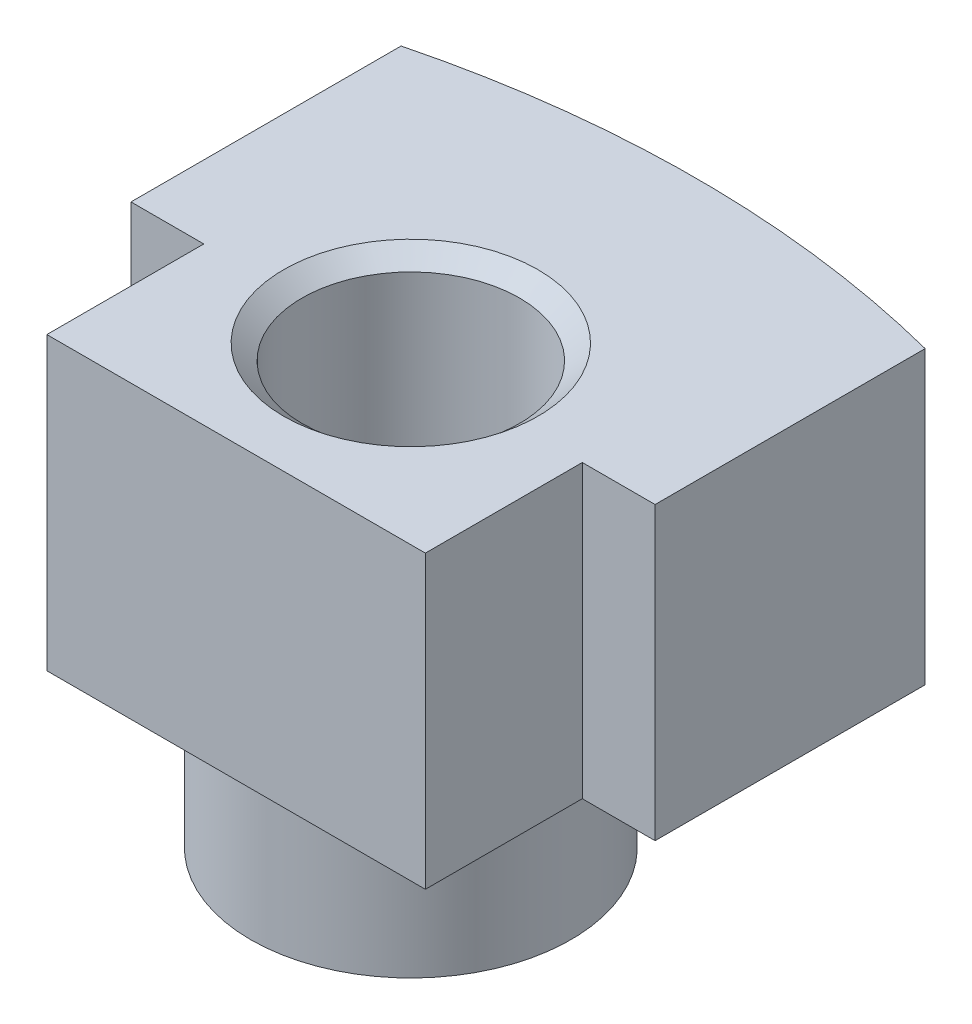
ISO-10303-21;
HEADER;
FILE_DESCRIPTION(('STEP AP214'),'2;1');
FILE_NAME('part.step','',(''),(''),'','','');
FILE_SCHEMA(('AUTOMOTIVE_DESIGN { 1 0 10303 214 1 1 1 1 }'));
ENDSEC;
DATA;
#1=APPLICATION_CONTEXT('core data for automotive mechanical design processes');
#2=APPLICATION_PROTOCOL_DEFINITION('international standard','automotive_design',2000,#1);
#3=PRODUCT_CONTEXT('',#1,'mechanical');
#4=PRODUCT('Part','Part','',(#3));
#5=PRODUCT_RELATED_PRODUCT_CATEGORY('part','',(#4));
#6=PRODUCT_DEFINITION_FORMATION('','',#4);
#7=PRODUCT_DEFINITION_CONTEXT('part definition',#1,'design');
#8=PRODUCT_DEFINITION('design','',#6,#7);
#9=PRODUCT_DEFINITION_SHAPE('','',#8);
#10=(LENGTH_UNIT() NAMED_UNIT(*) SI_UNIT(.MILLI.,.METRE.));
#11=(NAMED_UNIT(*) PLANE_ANGLE_UNIT() SI_UNIT($,.RADIAN.));
#12=(NAMED_UNIT(*) SI_UNIT($,.STERADIAN.) SOLID_ANGLE_UNIT());
#13=UNCERTAINTY_MEASURE_WITH_UNIT(LENGTH_MEASURE(1.E-05),#10,'distance_accuracy_value','');
#14=(GEOMETRIC_REPRESENTATION_CONTEXT(3) GLOBAL_UNCERTAINTY_ASSIGNED_CONTEXT((#13)) GLOBAL_UNIT_ASSIGNED_CONTEXT((#10,
#11,#12)) REPRESENTATION_CONTEXT('',''));
#15=CARTESIAN_POINT('',(0.,0.,0.));
#16=DIRECTION('',(0.,0.,1.));
#17=DIRECTION('',(1.,0.,0.));
#18=AXIS2_PLACEMENT_3D('',#15,#16,#17);
#19=CARTESIAN_POINT('',(-22.86,25.4,0.));
#20=DIRECTION('',(1.,0.,0.));
#21=DIRECTION('',(0.,0.,-1.));
#22=AXIS2_PLACEMENT_3D('',#19,#20,#21);
#23=PLANE('',#22);
#24=DIRECTION('',(0.,0.,1.));
#25=VECTOR('',#24,1.);
#26=CARTESIAN_POINT('',(-22.86,0.,0.));
#27=LINE('',#26,#25);
#28=CARTESIAN_POINT('',(-22.8600000000001,0.,0.));
#29=VERTEX_POINT('',#28);
#30=CARTESIAN_POINT('',(-22.86,0.,23.5589088817742));
#31=VERTEX_POINT('',#30);
#32=EDGE_CURVE('E147',#29,#31,#27,.T.);
#33=ORIENTED_EDGE('',*,*,#32,.T.);
#34=DIRECTION('',(0.,-1.,0.));
#35=VECTOR('',#34,1.);
#36=CARTESIAN_POINT('',(-22.86,25.4,23.5589088817742));
#37=LINE('',#36,#35);
#38=CARTESIAN_POINT('',(-22.86,25.4,23.5589088817742));
#39=VERTEX_POINT('',#38);
#40=EDGE_CURVE('E53',#39,#31,#37,.T.);
#41=ORIENTED_EDGE('',*,*,#40,.F.);
#42=DIRECTION('',(0.,0.,1.));
#43=VECTOR('',#42,1.);
#44=CARTESIAN_POINT('',(-22.86,25.4,0.));
#45=LINE('',#44,#43);
#46=CARTESIAN_POINT('',(-22.8600000000001,25.4,0.));
#47=VERTEX_POINT('',#46);
#48=EDGE_CURVE('E164',#47,#39,#45,.T.);
#49=ORIENTED_EDGE('',*,*,#48,.F.);
#50=DIRECTION('',(0.,-1.,0.));
#51=VECTOR('',#50,1.);
#52=CARTESIAN_POINT('',(-22.8600000000001,25.4,0.));
#53=LINE('',#52,#51);
#54=EDGE_CURVE('E62',#47,#29,#53,.T.);
#55=ORIENTED_EDGE('',*,*,#54,.T.);
#56=EDGE_LOOP('',(#33,#41,#49,#55));
#57=FACE_BOUND('',#56,.T.);
#58=ADVANCED_FACE('F39',(#57),#23,.F.);
#59=CARTESIAN_POINT('',(-22.86,25.4,23.5589088817742));
#60=DIRECTION('',(0.,0.,-1.));
#61=DIRECTION('',(-1.,0.,0.));
#62=AXIS2_PLACEMENT_3D('',#59,#60,#61);
#63=PLANE('',#62);
#64=DIRECTION('',(1.,0.,0.));
#65=VECTOR('',#64,1.);
#66=CARTESIAN_POINT('',(-22.86,0.,23.5589088817742));
#67=LINE('',#66,#65);
#68=CARTESIAN_POINT('',(-16.51,0.,23.5589088817742));
#69=VERTEX_POINT('',#68);
#70=EDGE_CURVE('E149',#31,#69,#67,.T.);
#71=ORIENTED_EDGE('',*,*,#70,.T.);
#72=DIRECTION('',(0.,-1.,0.));
#73=VECTOR('',#72,1.);
#74=CARTESIAN_POINT('',(-16.51,25.4,23.5589088817742));
#75=LINE('',#74,#73);
#76=CARTESIAN_POINT('',(-16.51,25.4,23.5589088817742));
#77=VERTEX_POINT('',#76);
#78=EDGE_CURVE('E174',#77,#69,#75,.T.);
#79=ORIENTED_EDGE('',*,*,#78,.F.);
#80=DIRECTION('',(1.,0.,0.));
#81=VECTOR('',#80,1.);
#82=CARTESIAN_POINT('',(-22.86,25.4,23.5589088817742));
#83=LINE('',#82,#81);
#84=EDGE_CURVE('E103',#39,#77,#83,.T.);
#85=ORIENTED_EDGE('',*,*,#84,.F.);
#86=ORIENTED_EDGE('',*,*,#40,.T.);
#87=EDGE_LOOP('',(#71,#79,#85,#86));
#88=FACE_BOUND('',#87,.T.);
#89=ADVANCED_FACE('F231',(#88),#63,.F.);
#90=CARTESIAN_POINT('',(-16.51,25.4,23.5589088817742));
#91=DIRECTION('',(1.,0.,0.));
#92=DIRECTION('',(0.,0.,-1.));
#93=AXIS2_PLACEMENT_3D('',#90,#91,#92);
#94=PLANE('',#93);
#95=DIRECTION('',(0.,0.,1.));
#96=VECTOR('',#95,1.);
#97=CARTESIAN_POINT('',(-16.51,0.,23.5589088817742));
#98=LINE('',#97,#96);
#99=CARTESIAN_POINT('',(-16.51,0.,37.249073779008));
#100=VERTEX_POINT('',#99);
#101=EDGE_CURVE('E152',#69,#100,#98,.T.);
#102=ORIENTED_EDGE('',*,*,#101,.T.);
#103=DIRECTION('',(0.,-1.,0.));
#104=VECTOR('',#103,1.);
#105=CARTESIAN_POINT('',(-16.51,25.4,37.249073779008));
#106=LINE('',#105,#104);
#107=CARTESIAN_POINT('',(-16.51,25.4,37.249073779008));
#108=VERTEX_POINT('',#107);
#109=EDGE_CURVE('E171',#108,#100,#106,.T.);
#110=ORIENTED_EDGE('',*,*,#109,.F.);
#111=DIRECTION('',(0.,0.,1.));
#112=VECTOR('',#111,1.);
#113=CARTESIAN_POINT('',(-16.51,25.4,23.5589088817742));
#114=LINE('',#113,#112);
#115=EDGE_CURVE('E267',#77,#108,#114,.T.);
#116=ORIENTED_EDGE('',*,*,#115,.F.);
#117=ORIENTED_EDGE('',*,*,#78,.T.);
#118=EDGE_LOOP('',(#102,#110,#116,#117));
#119=FACE_BOUND('',#118,.T.);
#120=ADVANCED_FACE('F235',(#119),#94,.F.);
#121=CARTESIAN_POINT('',(-16.51,25.4,37.249073779008));
#122=DIRECTION('',(0.,0.,-1.));
#123=DIRECTION('',(-1.,0.,0.));
#124=AXIS2_PLACEMENT_3D('',#121,#122,#123);
#125=PLANE('',#124);
#126=DIRECTION('',(1.,0.,0.));
#127=VECTOR('',#126,1.);
#128=CARTESIAN_POINT('',(-16.51,0.,37.249073779008));
#129=LINE('',#128,#127);
#130=CARTESIAN_POINT('',(16.51,0.,37.249073779008));
#131=VERTEX_POINT('',#130);
#132=EDGE_CURVE('E154',#100,#131,#129,.T.);
#133=ORIENTED_EDGE('',*,*,#132,.T.);
#134=DIRECTION('',(0.,-1.,0.));
#135=VECTOR('',#134,1.);
#136=CARTESIAN_POINT('',(16.51,25.4,37.249073779008));
#137=LINE('',#136,#135);
#138=CARTESIAN_POINT('',(16.51,25.4,37.249073779008));
#139=VERTEX_POINT('',#138);
#140=EDGE_CURVE('E168',#139,#131,#137,.T.);
#141=ORIENTED_EDGE('',*,*,#140,.F.);
#142=DIRECTION('',(1.,0.,0.));
#143=VECTOR('',#142,1.);
#144=CARTESIAN_POINT('',(-16.51,25.4,37.249073779008));
#145=LINE('',#144,#143);
#146=EDGE_CURVE('E269',#108,#139,#145,.T.);
#147=ORIENTED_EDGE('',*,*,#146,.F.);
#148=ORIENTED_EDGE('',*,*,#109,.T.);
#149=EDGE_LOOP('',(#133,#141,#147,#148));
#150=FACE_BOUND('',#149,.T.);
#151=ADVANCED_FACE('F275',(#150),#125,.F.);
#152=CARTESIAN_POINT('',(16.51,25.4,37.249073779008));
#153=DIRECTION('',(-1.,0.,0.));
#154=DIRECTION('',(0.,0.,1.));
#155=AXIS2_PLACEMENT_3D('',#152,#153,#154);
#156=PLANE('',#155);
#157=DIRECTION('',(0.,0.,-1.));
#158=VECTOR('',#157,1.);
#159=CARTESIAN_POINT('',(16.51,0.,37.249073779008));
#160=LINE('',#159,#158);
#161=CARTESIAN_POINT('',(16.51,0.,23.5589088817742));
#162=VERTEX_POINT('',#161);
#163=EDGE_CURVE('E156',#131,#162,#160,.T.);
#164=ORIENTED_EDGE('',*,*,#163,.T.);
#165=DIRECTION('',(0.,-1.,0.));
#166=VECTOR('',#165,1.);
#167=CARTESIAN_POINT('',(16.51,25.4,23.5589088817742));
#168=LINE('',#167,#166);
#169=CARTESIAN_POINT('',(16.51,25.4,23.5589088817742));
#170=VERTEX_POINT('',#169);
#171=EDGE_CURVE('E139',#170,#162,#168,.T.);
#172=ORIENTED_EDGE('',*,*,#171,.F.);
#173=DIRECTION('',(0.,0.,-1.));
#174=VECTOR('',#173,1.);
#175=CARTESIAN_POINT('',(16.51,25.4,37.249073779008));
#176=LINE('',#175,#174);
#177=EDGE_CURVE('E127',#139,#170,#176,.T.);
#178=ORIENTED_EDGE('',*,*,#177,.F.);
#179=ORIENTED_EDGE('',*,*,#140,.T.);
#180=EDGE_LOOP('',(#164,#172,#178,#179));
#181=FACE_BOUND('',#180,.T.);
#182=ADVANCED_FACE('F279',(#181),#156,.F.);
#183=CARTESIAN_POINT('',(16.51,25.4,23.5589088817742));
#184=DIRECTION('',(0.,0.,-1.));
#185=DIRECTION('',(-1.,0.,0.));
#186=AXIS2_PLACEMENT_3D('',#183,#184,#185);
#187=PLANE('',#186);
#188=DIRECTION('',(1.,0.,0.));
#189=VECTOR('',#188,1.);
#190=CARTESIAN_POINT('',(16.51,0.,23.5589088817742));
#191=LINE('',#190,#189);
#192=CARTESIAN_POINT('',(22.86,0.,23.5589088817742));
#193=VERTEX_POINT('',#192);
#194=EDGE_CURVE('E136',#162,#193,#191,.T.);
#195=ORIENTED_EDGE('',*,*,#194,.T.);
#196=DIRECTION('',(0.,-1.,0.));
#197=VECTOR('',#196,1.);
#198=CARTESIAN_POINT('',(22.86,25.4,23.5589088817742));
#199=LINE('',#198,#197);
#200=CARTESIAN_POINT('',(22.86,25.4,23.5589088817742));
#201=VERTEX_POINT('',#200);
#202=EDGE_CURVE('E133',#201,#193,#199,.T.);
#203=ORIENTED_EDGE('',*,*,#202,.F.);
#204=DIRECTION('',(1.,0.,0.));
#205=VECTOR('',#204,1.);
#206=CARTESIAN_POINT('',(16.51,25.4,23.5589088817742));
#207=LINE('',#206,#205);
#208=EDGE_CURVE('E120',#170,#201,#207,.T.);
#209=ORIENTED_EDGE('',*,*,#208,.F.);
#210=ORIENTED_EDGE('',*,*,#171,.T.);
#211=EDGE_LOOP('',(#195,#203,#209,#210));
#212=FACE_BOUND('',#211,.T.);
#213=ADVANCED_FACE('F134',(#212),#187,.F.);
#214=CARTESIAN_POINT('',(22.86,25.4,23.5589088817742));
#215=DIRECTION('',(-1.,0.,0.));
#216=DIRECTION('',(0.,0.,1.));
#217=AXIS2_PLACEMENT_3D('',#214,#215,#216);
#218=PLANE('',#217);
#219=DIRECTION('',(0.,0.,-1.));
#220=VECTOR('',#219,1.);
#221=CARTESIAN_POINT('',(22.86,0.,23.5589088817742));
#222=LINE('',#221,#220);
#223=CARTESIAN_POINT('',(22.86,0.,0.));
#224=VERTEX_POINT('',#223);
#225=EDGE_CURVE('E159',#193,#224,#222,.T.);
#226=ORIENTED_EDGE('',*,*,#225,.T.);
#227=DIRECTION('',(0.,-1.,0.));
#228=VECTOR('',#227,1.);
#229=CARTESIAN_POINT('',(22.86,25.4,0.));
#230=LINE('',#229,#228);
#231=CARTESIAN_POINT('',(22.86,25.4,0.));
#232=VERTEX_POINT('',#231);
#233=EDGE_CURVE('E90',#232,#224,#230,.T.);
#234=ORIENTED_EDGE('',*,*,#233,.F.);
#235=DIRECTION('',(0.,0.,-1.));
#236=VECTOR('',#235,1.);
#237=CARTESIAN_POINT('',(22.86,25.4,23.5589088817742));
#238=LINE('',#237,#236);
#239=EDGE_CURVE('E125',#201,#232,#238,.T.);
#240=ORIENTED_EDGE('',*,*,#239,.F.);
#241=ORIENTED_EDGE('',*,*,#202,.T.);
#242=EDGE_LOOP('',(#226,#234,#240,#241));
#243=FACE_BOUND('',#242,.T.);
#244=ADVANCED_FACE('F141',(#243),#218,.F.);
#245=CARTESIAN_POINT('',(0.,25.4,89.1920737790079));
#246=DIRECTION('',(0.,-1.,0.));
#247=DIRECTION('',(0.,0.,-1.));
#248=AXIS2_PLACEMENT_3D('',#245,#246,#247);
#249=CYLINDRICAL_SURFACE('',#248,92.075);
#250=CARTESIAN_POINT('',(14.2614559586827,12.7,-1.77174594586152));
#251=CARTESIAN_POINT('',(14.2614603533188,12.7961196289697,-1.7717453950074));
#252=CARTESIAN_POINT('',(14.2695081678372,12.8923093523432,-1.77048463882496));
#253=CARTESIAN_POINT('',(14.3014832826976,13.0820252849142,-1.76546275587858));
#254=CARTESIAN_POINT('',(14.3254297113671,13.175548143952,-1.7616986171748));
#255=CARTESIAN_POINT('',(14.3884639626877,13.3571392531633,-1.7517481191915));
#256=CARTESIAN_POINT('',(14.4275410537826,13.445211318126,-1.74556347664233));
#257=CARTESIAN_POINT('',(14.5196525595507,13.6134816682518,-1.73090174864494));
#258=CARTESIAN_POINT('',(14.5726837520116,13.6936817653084,-1.72242519242172));
#259=CARTESIAN_POINT('',(14.6914388483703,13.8444209717723,-1.70331044739684));
#260=CARTESIAN_POINT('',(14.7572249724037,13.9149097003826,-1.6926616482826));
#261=CARTESIAN_POINT('',(14.8993989689177,14.0438569318382,-1.66946216236067));
#262=CARTESIAN_POINT('',(14.9757877836869,14.1023143642833,-1.65691130650317));
#263=CARTESIAN_POINT('',(15.1379212558748,14.2062703240048,-1.63003687864567));
#264=CARTESIAN_POINT('',(15.2237639688249,14.2516110268191,-1.61569446975571));
#265=CARTESIAN_POINT('',(15.4016227875135,14.3272531916156,-1.58569755626434));
#266=CARTESIAN_POINT('',(15.493639322058,14.3575536077371,-1.57004296050547));
#267=CARTESIAN_POINT('',(15.6825035128265,14.4026560596245,-1.537601635518));
#268=CARTESIAN_POINT('',(15.7793983713567,14.4172518391944,-1.52080284948314));
#269=CARTESIAN_POINT('',(15.9741760090557,14.4298949338253,-1.4867059994806));
#270=CARTESIAN_POINT('',(16.0720588475231,14.4279412496193,-1.46940790542725));
#271=CARTESIAN_POINT('',(16.2669885971449,14.4074666680281,-1.43463640574327));
#272=CARTESIAN_POINT('',(16.3640195159862,14.3887934112297,-1.41716285227785));
#273=CARTESIAN_POINT('',(16.5535743091333,14.3351724872062,-1.38272452867528));
#274=CARTESIAN_POINT('',(16.6460980793492,14.3002244443215,-1.36575977029191));
#275=CARTESIAN_POINT('',(16.824023412731,14.2149639825025,-1.3328733751942));
#276=CARTESIAN_POINT('',(16.909422346999,14.1646459240324,-1.31695212397014));
#277=CARTESIAN_POINT('',(17.0705539485986,14.0499969926246,-1.28670021334974));
#278=CARTESIAN_POINT('',(17.146287043069,13.9856667392336,-1.27236948367105));
#279=CARTESIAN_POINT('',(17.2850705216544,13.8454935546296,-1.2459542419597));
#280=CARTESIAN_POINT('',(17.3482443457379,13.7697770021802,-1.23384796644308));
#281=CARTESIAN_POINT('',(17.4609322846516,13.608459992636,-1.21215606073376));
#282=CARTESIAN_POINT('',(17.5104477460246,13.522860511055,-1.20257018206599));
#283=CARTESIAN_POINT('',(17.5935190633821,13.3457821898317,-1.18643849297666));
#284=CARTESIAN_POINT('',(17.6273344533246,13.2544295992833,-1.17984329059852));
#285=CARTESIAN_POINT('',(17.6791670730477,13.0671863227575,-1.16971782241968));
#286=CARTESIAN_POINT('',(17.6971858570823,12.9712960842254,-1.16618725508483));
#287=CARTESIAN_POINT('',(17.7166935449307,12.7792540555839,-1.1623643690384));
#288=CARTESIAN_POINT('',(17.7184280433244,12.6831280989579,-1.16202393782441));
#289=CARTESIAN_POINT('',(17.7059542032347,12.4919596833571,-1.16446914955527));
#290=CARTESIAN_POINT('',(17.6917465296415,12.3969171793624,-1.16725466212838));
#291=CARTESIAN_POINT('',(17.6479409823015,12.2110538418184,-1.17582037408944));
#292=CARTESIAN_POINT('',(17.6184136908229,12.1202157104884,-1.18158683886038));
#293=CARTESIAN_POINT('',(17.5449216183881,11.9448182574812,-1.19588307194531));
#294=CARTESIAN_POINT('',(17.5009563947286,11.8602591284314,-1.20441292499161));
#295=CARTESIAN_POINT('',(17.3994795170647,11.6990273932609,-1.22400012378006));
#296=CARTESIAN_POINT('',(17.3418571596754,11.6224270117294,-1.23507810149021));
#297=CARTESIAN_POINT('',(17.2149626581334,11.4799615433362,-1.25932117257247));
#298=CARTESIAN_POINT('',(17.1456895665073,11.4140973304312,-1.27248643568404));
#299=CARTESIAN_POINT('',(16.9962273385183,11.2938092361717,-1.30068697239767));
#300=CARTESIAN_POINT('',(16.9158767008615,11.2395924402709,-1.3157495578751));
#301=CARTESIAN_POINT('',(16.7474353501808,11.1453979561586,-1.34706895025247));
#302=CARTESIAN_POINT('',(16.6593439549273,11.10542152459,-1.36332586239335));
#303=CARTESIAN_POINT('',(16.4763979394292,11.0402088481225,-1.3967925969903));
#304=CARTESIAN_POINT('',(16.3814578593669,11.0152178673555,-1.41401348224276));
#305=CARTESIAN_POINT('',(16.1887505789177,10.9816434232138,-1.44864313097854));
#306=CARTESIAN_POINT('',(16.0909832157699,10.9730609063575,-1.46605190524195));
#307=CARTESIAN_POINT('',(15.8945735763547,10.9725488491729,-1.5006942684163));
#308=CARTESIAN_POINT('',(15.7959304804109,10.9807511637867,-1.51792539329304));
#309=CARTESIAN_POINT('',(15.6013541923074,11.0138930904106,-1.55159335273847));
#310=CARTESIAN_POINT('',(15.5054210010819,11.0388327081903,-1.56803018703335));
#311=CARTESIAN_POINT('',(15.3192980045275,11.1047261339489,-1.59963083380461));
#312=CARTESIAN_POINT('',(15.2290931838738,11.1456358799098,-1.61479801065931));
#313=CARTESIAN_POINT('',(15.0568029008807,11.2423893789058,-1.64352468084361));
#314=CARTESIAN_POINT('',(14.9747167097969,11.2982317898853,-1.65708431849089));
#315=CARTESIAN_POINT('',(14.8219665928546,11.4226378794827,-1.68212976033619));
#316=CARTESIAN_POINT('',(14.7511887795845,11.4910575084571,-1.69363639906966));
#317=CARTESIAN_POINT('',(14.6221231914102,11.6391267196263,-1.71449047684255));
#318=CARTESIAN_POINT('',(14.5638376671427,11.7187783211182,-1.72383752682959));
#319=CARTESIAN_POINT('',(14.4622338288553,11.8859331891261,-1.74005497526557));
#320=CARTESIAN_POINT('',(14.4187347060203,11.9733238001375,-1.74695534054292));
#321=CARTESIAN_POINT('',(14.3470672919257,12.1542441018886,-1.75828968789799));
#322=CARTESIAN_POINT('',(14.3188792638526,12.2477657142268,-1.76272684534456));
#323=CARTESIAN_POINT('',(14.2863692220959,12.4016006970819,-1.76783730456125));
#324=CARTESIAN_POINT('',(14.2770391994481,12.4608765224341,-1.76930163392431));
#325=CARTESIAN_POINT('',(14.2645812157309,12.5800924736035,-1.77125612344653));
#326=CARTESIAN_POINT('',(14.2614532169439,12.6400325953784,-1.77174628953005));
#327=CARTESIAN_POINT('',(14.2614559586827,12.7,-1.77174594586152));
#328=B_SPLINE_CURVE_WITH_KNOTS('',3,(#250,#251,#252,#253,#254,#255,#256,#257,#258,#259,#260,
#261,#262,#263,#264,#265,#266,#267,#268,#269,#270,#271,#272,#273,#274,#275,#276,#277,#278,#279,
#280,#281,#282,#283,#284,#285,#286,#287,#288,#289,#290,#291,#292,#293,#294,#295,#296,#297,#298,
#299,#300,#301,#302,#303,#304,#305,#306,#307,#308,#309,#310,#311,#312,#313,#314,#315,#316,#317,
#318,#319,#320,#321,#322,#323,#324,#325,#326,#327),.UNSPECIFIED.,.T.,.F.,(4,2,2,2,2,2,2,2,2,2,2,
2,2,2,2,2,2,2,2,2,2,2,2,2,2,2,2,2,2,2,2,2,2,2,2,2,2,2,4),(0.,0.288138724503131,
0.576624751234644,0.864906540394838,1.15312181927248,1.44278012626212,1.73246419243801,
2.02550120941892,2.31855860054218,2.61541955614697,2.91229843652868,3.21191051362014,
3.51152950679342,3.81125856790267,4.11097437923158,4.40758040147358,4.70415717163238,
4.9956395319583,5.28709320963522,5.57414407979596,5.86118297855387,6.14691099123382,
6.43264776586895,6.720785076461,7.00894583060268,7.30186945829835,7.59481892868329,
7.89244072454558,8.19007968813479,8.49006575867888,8.79005193263003,9.08921622061447,
9.38835363059548,9.68425721024495,9.98021405576756,10.2724094816917,10.5642273529071,
10.7439933044327,10.9237581627102),.UNSPECIFIED.);
#329=CARTESIAN_POINT('',(14.2614559586827,12.7,-1.77174594586152));
#330=VERTEX_POINT('',#329);
#331=EDGE_CURVE('E42',#330,#330,#328,.T.);
#332=ORIENTED_EDGE('',*,*,#331,.F.);
#333=EDGE_LOOP('',(#332));
#334=FACE_BOUND('',#333,.T.);
#335=CARTESIAN_POINT('',(-17.7158559586827,12.7,-1.16252805538235));
#336=CARTESIAN_POINT('',(-17.7158514921566,12.7957106567667,-1.16252906968502));
#337=CARTESIAN_POINT('',(-17.7078711636359,12.891491478623,-1.16409477194511));
#338=CARTESIAN_POINT('',(-17.6761741129148,13.08038894458,-1.17030082471579));
#339=CARTESIAN_POINT('',(-17.6524383629067,13.1735022250775,-1.17494489295661));
#340=CARTESIAN_POINT('',(-17.5899923716936,13.354273676167,-1.18712072077957));
#341=CARTESIAN_POINT('',(-17.5512956023105,13.4419366723285,-1.19464988239221));
#342=CARTESIAN_POINT('',(-17.4601209299164,13.6094532105732,-1.21230635735188));
#343=CARTESIAN_POINT('',(-17.4076458851043,13.689308367624,-1.22243313183372));
#344=CARTESIAN_POINT('',(-17.2899474795346,13.8397639401564,-1.24501458867515));
#345=CARTESIAN_POINT('',(-17.2246164869864,13.9102771712027,-1.25748888337677));
#346=CARTESIAN_POINT('',(-17.0833946556945,14.0393738797641,-1.28426792677456));
#347=CARTESIAN_POINT('',(-17.0075025595772,14.09795593474,-1.29857289340876));
#348=CARTESIAN_POINT('',(-16.8458914629408,14.202595391443,-1.32879911228642));
#349=CARTESIAN_POINT('',(-16.7600249605074,14.248418158673,-1.34474407766946));
#350=CARTESIAN_POINT('',(-16.5819724579459,14.3249889761659,-1.37752378946814));
#351=CARTESIAN_POINT('',(-16.4897859344639,14.355735776282,-1.39435860954516));
#352=CARTESIAN_POINT('',(-16.3003053307657,14.4016845004542,-1.4286471581766));
#353=CARTESIAN_POINT('',(-16.2029576179327,14.4166614972993,-1.44610626316602));
#354=CARTESIAN_POINT('',(-16.0071078713405,14.4298882462594,-1.48089912087174));
#355=CARTESIAN_POINT('',(-15.9086057949677,14.4281373789078,-1.49823286892204));
#356=CARTESIAN_POINT('',(-15.7127693842133,14.4078760953217,-1.53236851038683));
#357=CARTESIAN_POINT('',(-15.6154425131813,14.3892885622167,-1.54916758801054));
#358=CARTESIAN_POINT('',(-15.4252248467777,14.335704119446,-1.58169654680617));
#359=CARTESIAN_POINT('',(-15.3323339738219,14.3007074968855,-1.59742644667966));
#360=CARTESIAN_POINT('',(-15.1542237598835,14.2154650982456,-1.62732527533931));
#361=CARTESIAN_POINT('',(-15.0689637352142,14.1653073178086,-1.64150258515934));
#362=CARTESIAN_POINT('',(-14.9080615001171,14.0510258567102,-1.66804941199495));
#363=CARTESIAN_POINT('',(-14.8324186983675,13.9869030353577,-1.68041904016413));
#364=CARTESIAN_POINT('',(-14.6938985812745,13.8473332022407,-1.70291973619273));
#365=CARTESIAN_POINT('',(-14.63087795157,13.7720325152607,-1.71307606662007));
#366=CARTESIAN_POINT('',(-14.518391831555,13.6116653062952,-1.73110907167612));
#367=CARTESIAN_POINT('',(-14.4689253587621,13.5265994927762,-1.73898591153759));
#368=CARTESIAN_POINT('',(-14.3856211384379,13.3502949018103,-1.75220198444148));
#369=CARTESIAN_POINT('',(-14.351590847541,13.2591494246949,-1.75757250594037));
#370=CARTESIAN_POINT('',(-14.2992800309489,13.0723382966676,-1.76581166004807));
#371=CARTESIAN_POINT('',(-14.2809986112562,12.9766729026578,-1.76868043467069));
#372=CARTESIAN_POINT('',(-14.2608414971998,12.784455257245,-1.77184285545281));
#373=CARTESIAN_POINT('',(-14.2588205769799,12.6879185834666,-1.77215929708412));
#374=CARTESIAN_POINT('',(-14.2708636696137,12.4958805752871,-1.77027068871671));
#375=CARTESIAN_POINT('',(-14.2849272805851,12.4003792150782,-1.76806570171751));
#376=CARTESIAN_POINT('',(-14.328654537298,12.21336431738,-1.76118766384539));
#377=CARTESIAN_POINT('',(-14.3582792748136,12.1218414474981,-1.75652076847504));
#378=CARTESIAN_POINT('',(-14.4322117265397,11.9450974851541,-1.74481797715537));
#379=CARTESIAN_POINT('',(-14.4765196122121,11.8598764662958,-1.7377820535418));
#380=CARTESIAN_POINT('',(-14.5787321201946,11.6977218885957,-1.72145037992701));
#381=CARTESIAN_POINT('',(-14.6366972414767,11.6208274937612,-1.71214456808625));
#382=CARTESIAN_POINT('',(-14.764407549409,11.4778606626161,-1.69148946848727));
#383=CARTESIAN_POINT('',(-14.8341532765361,11.411788723098,-1.68014008697149));
#384=CARTESIAN_POINT('',(-14.984186635366,11.2915985495354,-1.65552169144823));
#385=CARTESIAN_POINT('',(-15.0645754722156,11.2376104816506,-1.64223410505052));
#386=CARTESIAN_POINT('',(-15.2330212127705,11.1438739728606,-1.61413731636127));
#387=CARTESIAN_POINT('',(-15.3210786251988,11.1041264775517,-1.59932801310933));
#388=CARTESIAN_POINT('',(-15.5035793225173,11.0394537490462,-1.56834337768002));
#389=CARTESIAN_POINT('',(-15.5980909056659,11.0147285565065,-1.55215275070584));
#390=CARTESIAN_POINT('',(-15.7897943926144,10.9815300283802,-1.518992136834));
#391=CARTESIAN_POINT('',(-15.8869864844156,10.9730578356774,-1.50202209521512));
#392=CARTESIAN_POINT('',(-16.0824280759154,10.9725510289675,-1.4675704068977));
#393=CARTESIAN_POINT('',(-16.1806774522211,10.980698170931,-1.45008518660517));
#394=CARTESIAN_POINT('',(-16.3744002132513,11.0135616598291,-1.41528978770367));
#395=CARTESIAN_POINT('',(-16.4698734882657,11.03827866067,-1.39797961603013));
#396=CARTESIAN_POINT('',(-16.6556811429299,11.1037437225733,-1.36400204359185));
#397=CARTESIAN_POINT('',(-16.7459958038482,11.1445491244384,-1.34733717868905));
#398=CARTESIAN_POINT('',(-16.9184963182033,11.2411014736068,-1.31526190671798));
#399=CARTESIAN_POINT('',(-17.0006826610157,11.2968475206392,-1.29985142413793));
#400=CARTESIAN_POINT('',(-17.1539343297532,11.4213205530527,-1.27092534531778));
#401=CARTESIAN_POINT('',(-17.2250756447989,11.4899509383859,-1.25739687475271));
#402=CARTESIAN_POINT('',(-17.3548016982634,11.6385886142346,-1.23259573918669));
#403=CARTESIAN_POINT('',(-17.4133843230494,11.7185978160464,-1.22132345392382));
#404=CARTESIAN_POINT('',(-17.5153364262797,11.8863903721321,-1.20162776232127));
#405=CARTESIAN_POINT('',(-17.5589255346232,11.9740356086946,-1.19316329820831));
#406=CARTESIAN_POINT('',(-17.6306971924666,12.1555555302828,-1.17919096981564));
#407=CARTESIAN_POINT('',(-17.658900477881,12.2494216388408,-1.17367912638629));
#408=CARTESIAN_POINT('',(-17.6912257238836,12.4032907268997,-1.16735461946999));
#409=CARTESIAN_POINT('',(-17.7004493210504,12.4622300823168,-1.1655476963982));
#410=CARTESIAN_POINT('',(-17.7127657982082,12.5807705518197,-1.16313410457829));
#411=CARTESIAN_POINT('',(-17.7158587413565,12.640371659082,-1.16252742346541));
#412=CARTESIAN_POINT('',(-17.7158559586827,12.7,-1.16252805538235));
#413=B_SPLINE_CURVE_WITH_KNOTS('',3,(#335,#336,#337,#338,#339,#340,#341,#342,#343,#344,#345,
#346,#347,#348,#349,#350,#351,#352,#353,#354,#355,#356,#357,#358,#359,#360,#361,#362,#363,#364,
#365,#366,#367,#368,#369,#370,#371,#372,#373,#374,#375,#376,#377,#378,#379,#380,#381,#382,#383,
#384,#385,#386,#387,#388,#389,#390,#391,#392,#393,#394,#395,#396,#397,#398,#399,#400,#401,#402,
#403,#404,#405,#406,#407,#408,#409,#410,#411,#412),.UNSPECIFIED.,.T.,.F.,(4,2,2,2,2,2,2,2,2,2,2,
2,2,2,2,2,2,2,2,2,2,2,2,2,2,2,2,2,2,2,2,2,2,2,2,2,2,2,4),(0.,0.286912027786231,
0.574171190928872,0.861172288447754,1.14811389673188,1.43756870966538,1.72705801375815,
2.02156393622395,2.31609427592158,2.61477088334727,2.91345855141203,3.21352125299055,
3.51357870465589,3.8119270095381,4.1102569613808,4.40497911673546,4.6996799032966,
4.99059620113605,5.28149598378871,5.56979476436583,5.85808634176925,6.14566049732995,
6.43323801114349,6.72211421924714,7.01100368416857,7.30286943570625,7.59475456399646,
7.8904458675746,8.18615796290904,8.48512142321358,8.7840966823872,9.08414729668568,
9.38417983504598,9.68204675394447,9.97996376468283,10.2733097149684,10.5662593316157,
10.7450091702726,10.9237571674577),.UNSPECIFIED.);
#414=CARTESIAN_POINT('',(-17.7158559586827,12.7,-1.16252805538235));
#415=VERTEX_POINT('',#414);
#416=EDGE_CURVE('E177',#415,#415,#413,.T.);
#417=ORIENTED_EDGE('',*,*,#416,.F.);
#418=EDGE_LOOP('',(#417));
#419=FACE_BOUND('',#418,.T.);
#420=CARTESIAN_POINT('',(0.,0.,89.1920737790079));
#421=DIRECTION('',(0.,-1.,0.));
#422=DIRECTION('',(0.,0.,-1.));
#423=AXIS2_PLACEMENT_3D('',#420,#421,#422);
#424=CIRCLE('',#423,92.075);
#425=EDGE_CURVE('E161',#29,#224,#424,.T.);
#426=ORIENTED_EDGE('',*,*,#425,.F.);
#427=ORIENTED_EDGE('',*,*,#54,.F.);
#428=CARTESIAN_POINT('',(0.,25.4,89.1920737790079));
#429=DIRECTION('',(0.,-1.,0.));
#430=DIRECTION('',(0.,0.,-1.));
#431=AXIS2_PLACEMENT_3D('',#428,#429,#430);
#432=CIRCLE('',#431,92.075);
#433=EDGE_CURVE('E142',#47,#232,#432,.T.);
#434=ORIENTED_EDGE('',*,*,#433,.T.);
#435=ORIENTED_EDGE('',*,*,#233,.T.);
#436=EDGE_LOOP('',(#426,#427,#434,#435));
#437=FACE_BOUND('',#436,.T.);
#438=ADVANCED_FACE('F185',(#334,#419,#437),#249,.T.);
#439=CARTESIAN_POINT('',(0.,25.4,89.1920737790079));
#440=DIRECTION('',(0.,-1.,0.));
#441=DIRECTION('',(0.,0.,-1.));
#442=AXIS2_PLACEMENT_3D('',#439,#440,#441);
#443=PLANE('',#442);
#444=CARTESIAN_POINT('',(0.,25.4,22.009073779008));
#445=DIRECTION('',(0.,1.,0.));
#446=DIRECTION('',(0.,0.,1.));
#447=AXIS2_PLACEMENT_3D('',#444,#445,#446);
#448=CIRCLE('',#447,11.0871);
#449=CARTESIAN_POINT('',(0.,25.4,33.0961737790079));
#450=VERTEX_POINT('',#449);
#451=EDGE_CURVE('E183',#450,#450,#448,.T.);
#452=ORIENTED_EDGE('',*,*,#451,.F.);
#453=EDGE_LOOP('',(#452));
#454=FACE_BOUND('',#453,.T.);
#455=ORIENTED_EDGE('',*,*,#48,.T.);
#456=ORIENTED_EDGE('',*,*,#84,.T.);
#457=ORIENTED_EDGE('',*,*,#115,.T.);
#458=ORIENTED_EDGE('',*,*,#146,.T.);
#459=ORIENTED_EDGE('',*,*,#177,.T.);
#460=ORIENTED_EDGE('',*,*,#208,.T.);
#461=ORIENTED_EDGE('',*,*,#239,.T.);
#462=ORIENTED_EDGE('',*,*,#433,.F.);
#463=EDGE_LOOP('',(#455,#456,#457,#458,#459,#460,#461,#462));
#464=FACE_BOUND('',#463,.T.);
#465=ADVANCED_FACE('F122',(#454,#464),#443,.F.);
#466=CARTESIAN_POINT('',(0.,0.,89.1920737790079));
#467=DIRECTION('',(0.,-1.,0.));
#468=DIRECTION('',(0.,0.,-1.));
#469=AXIS2_PLACEMENT_3D('',#466,#467,#468);
#470=PLANE('',#469);
#471=CARTESIAN_POINT('',(0.,0.,22.009073779008));
#472=DIRECTION('',(0.,-1.,0.));
#473=DIRECTION('',(0.,0.,-1.));
#474=AXIS2_PLACEMENT_3D('',#471,#472,#473);
#475=CIRCLE('',#474,13.97);
#476=CARTESIAN_POINT('',(0.,0.,8.03907377900795));
#477=VERTEX_POINT('',#476);
#478=EDGE_CURVE('E11',#477,#477,#475,.T.);
#479=ORIENTED_EDGE('',*,*,#478,.F.);
#480=EDGE_LOOP('',(#479));
#481=FACE_BOUND('',#480,.T.);
#482=ORIENTED_EDGE('',*,*,#32,.F.);
#483=ORIENTED_EDGE('',*,*,#425,.T.);
#484=ORIENTED_EDGE('',*,*,#225,.F.);
#485=ORIENTED_EDGE('',*,*,#194,.F.);
#486=ORIENTED_EDGE('',*,*,#163,.F.);
#487=ORIENTED_EDGE('',*,*,#132,.F.);
#488=ORIENTED_EDGE('',*,*,#101,.F.);
#489=ORIENTED_EDGE('',*,*,#70,.F.);
#490=EDGE_LOOP('',(#482,#483,#484,#485,#486,#487,#488,#489));
#491=FACE_BOUND('',#490,.T.);
#492=ADVANCED_FACE('F219',(#481,#491),#470,.T.);
#493=CARTESIAN_POINT('',(0.,-12.7,22.009073779008));
#494=DIRECTION('',(0.,1.,0.));
#495=DIRECTION('',(0.,0.,1.));
#496=AXIS2_PLACEMENT_3D('',#493,#494,#495);
#497=CYLINDRICAL_SURFACE('',#496,13.97);
#498=CARTESIAN_POINT('',(0.,-12.7,22.009073779008));
#499=DIRECTION('',(0.,-1.,0.));
#500=DIRECTION('',(0.,0.,-1.));
#501=AXIS2_PLACEMENT_3D('',#498,#499,#500);
#502=CIRCLE('',#501,13.97);
#503=CARTESIAN_POINT('',(0.,-12.7,8.03907377900795));
#504=VERTEX_POINT('',#503);
#505=EDGE_CURVE('E150',#504,#504,#502,.T.);
#506=ORIENTED_EDGE('',*,*,#505,.F.);
#507=EDGE_LOOP('',(#506));
#508=FACE_BOUND('',#507,.T.);
#509=ORIENTED_EDGE('',*,*,#478,.T.);
#510=EDGE_LOOP('',(#509));
#511=FACE_BOUND('',#510,.T.);
#512=ADVANCED_FACE('F215',(#508,#511),#497,.T.);
#513=CARTESIAN_POINT('',(0.,-12.7,22.009073779008));
#514=DIRECTION('',(0.,-1.,0.));
#515=DIRECTION('',(0.,0.,-1.));
#516=AXIS2_PLACEMENT_3D('',#513,#514,#515);
#517=PLANE('',#516);
#518=ORIENTED_EDGE('',*,*,#505,.T.);
#519=EDGE_LOOP('',(#518));
#520=FACE_BOUND('',#519,.T.);
#521=ADVANCED_FACE('F211',(#520),#517,.T.);
#522=CARTESIAN_POINT('',(0.,0.,22.009073779008));
#523=DIRECTION('',(0.,1.,0.));
#524=DIRECTION('',(0.,0.,1.));
#525=AXIS2_PLACEMENT_3D('',#522,#523,#524);
#526=CONICAL_SURFACE('',#525,9.4869,1.02974425867665);
#527=CARTESIAN_POINT('',(0.,-5.70030460665256,22.009073779008));
#528=VERTEX_POINT('',#527);
#529=VERTEX_LOOP('',#528);
#530=FACE_BOUND('',#529,.T.);
#531=CARTESIAN_POINT('',(0.,0.,22.009073779008));
#532=DIRECTION('',(0.,1.,0.));
#533=DIRECTION('',(0.,0.,1.));
#534=AXIS2_PLACEMENT_3D('',#531,#532,#533);
#535=CIRCLE('',#534,9.4869);
#536=CARTESIAN_POINT('',(0.,0.,31.4959737790079));
#537=VERTEX_POINT('',#536);
#538=EDGE_CURVE('E260',#537,#537,#535,.T.);
#539=ORIENTED_EDGE('',*,*,#538,.T.);
#540=EDGE_LOOP('',(#539));
#541=FACE_BOUND('',#540,.T.);
#542=ADVANCED_FACE('F207',(#530,#541),#526,.F.);
#543=CARTESIAN_POINT('',(0.,25.4,22.009073779008));
#544=DIRECTION('',(0.,1.,0.));
#545=DIRECTION('',(0.,0.,1.));
#546=AXIS2_PLACEMENT_3D('',#543,#544,#545);
#547=CYLINDRICAL_SURFACE('',#546,9.4869);
#548=ORIENTED_EDGE('',*,*,#538,.F.);
#549=EDGE_LOOP('',(#548));
#550=FACE_BOUND('',#549,.T.);
#551=CARTESIAN_POINT('',(0.,24.0572727701901,22.009073779008));
#552=DIRECTION('',(0.,1.,0.));
#553=DIRECTION('',(0.,0.,1.));
#554=AXIS2_PLACEMENT_3D('',#551,#552,#553);
#555=CIRCLE('',#554,9.4869);
#556=CARTESIAN_POINT('',(0.,24.0572727701901,31.495973779008));
#557=VERTEX_POINT('',#556);
#558=EDGE_CURVE('E257',#557,#557,#555,.T.);
#559=ORIENTED_EDGE('',*,*,#558,.T.);
#560=EDGE_LOOP('',(#559));
#561=FACE_BOUND('',#560,.T.);
#562=ADVANCED_FACE('F203',(#550,#561),#547,.F.);
#563=CARTESIAN_POINT('',(0.,25.4,22.009073779008));
#564=DIRECTION('',(0.,1.,0.));
#565=DIRECTION('',(0.,0.,1.));
#566=AXIS2_PLACEMENT_3D('',#563,#564,#565);
#567=CONICAL_SURFACE('',#566,11.0871,0.872664625997163);
#568=ORIENTED_EDGE('',*,*,#558,.F.);
#569=EDGE_LOOP('',(#568));
#570=FACE_BOUND('',#569,.T.);
#571=ORIENTED_EDGE('',*,*,#451,.T.);
#572=EDGE_LOOP('',(#571));
#573=FACE_BOUND('',#572,.T.);
#574=ADVANCED_FACE('F199',(#570,#573),#567,.F.);
#575=CARTESIAN_POINT('',(-15.9886559586827,12.7,18.5818999204089));
#576=DIRECTION('',(0.,0.,-1.));
#577=DIRECTION('',(-1.,0.,0.));
#578=AXIS2_PLACEMENT_3D('',#575,#576,#577);
#579=CONICAL_SURFACE('',#578,1.72719999999999,1.02974425867665);
#580=CARTESIAN_POINT('',(-15.9886559586827,12.7,19.6197063815933));
#581=VERTEX_POINT('',#580);
#582=VERTEX_LOOP('',#581);
#583=FACE_BOUND('',#582,.T.);
#584=CARTESIAN_POINT('',(-15.9886559586827,12.7,18.5818999204089));
#585=DIRECTION('',(0.,0.,-1.));
#586=DIRECTION('',(-1.,0.,0.));
#587=AXIS2_PLACEMENT_3D('',#584,#585,#586);
#588=CIRCLE('',#587,1.72719999999999);
#589=CARTESIAN_POINT('',(-17.7158559586827,12.7,18.5818999204089));
#590=VERTEX_POINT('',#589);
#591=EDGE_CURVE('E184',#590,#590,#588,.T.);
#592=ORIENTED_EDGE('',*,*,#591,.T.);
#593=EDGE_LOOP('',(#592));
#594=FACE_BOUND('',#593,.T.);
#595=ADVANCED_FACE('F195',(#583,#594),#579,.F.);
#596=CARTESIAN_POINT('',(-15.9886559586827,12.7,-2.75410007959111));
#597=DIRECTION('',(0.,0.,-1.));
#598=DIRECTION('',(-1.,0.,0.));
#599=AXIS2_PLACEMENT_3D('',#596,#597,#598);
#600=CYLINDRICAL_SURFACE('',#599,1.72719999999999);
#601=ORIENTED_EDGE('',*,*,#416,.T.);
#602=EDGE_LOOP('',(#601));
#603=FACE_BOUND('',#602,.T.);
#604=ORIENTED_EDGE('',*,*,#591,.F.);
#605=EDGE_LOOP('',(#604));
#606=FACE_BOUND('',#605,.T.);
#607=ADVANCED_FACE('F189',(#603,#606),#600,.F.);
#608=CARTESIAN_POINT('',(15.9886559586827,12.7,18.5818999204089));
#609=DIRECTION('',(0.,0.,-1.));
#610=DIRECTION('',(-1.,0.,0.));
#611=AXIS2_PLACEMENT_3D('',#608,#609,#610);
#612=CONICAL_SURFACE('',#611,1.72719999999999,1.02974425867665);
#613=CARTESIAN_POINT('',(15.9886559586827,12.7,19.6197063815933));
#614=VERTEX_POINT('',#613);
#615=VERTEX_LOOP('',#614);
#616=FACE_BOUND('',#615,.T.);
#617=CARTESIAN_POINT('',(15.9886559586827,12.7,18.5818999204089));
#618=DIRECTION('',(0.,0.,-1.));
#619=DIRECTION('',(-1.,0.,0.));
#620=AXIS2_PLACEMENT_3D('',#617,#618,#619);
#621=CIRCLE('',#620,1.72719999999999);
#622=CARTESIAN_POINT('',(14.2614559586827,12.7,18.5818999204089));
#623=VERTEX_POINT('',#622);
#624=EDGE_CURVE('E252',#623,#623,#621,.T.);
#625=ORIENTED_EDGE('',*,*,#624,.T.);
#626=EDGE_LOOP('',(#625));
#627=FACE_BOUND('',#626,.T.);
#628=ADVANCED_FACE('F194',(#616,#627),#612,.F.);
#629=CARTESIAN_POINT('',(15.9886559586827,12.7,-2.75410007959111));
#630=DIRECTION('',(0.,0.,-1.));
#631=DIRECTION('',(-1.,0.,0.));
#632=AXIS2_PLACEMENT_3D('',#629,#630,#631);
#633=CYLINDRICAL_SURFACE('',#632,1.72719999999999);
#634=ORIENTED_EDGE('',*,*,#331,.T.);
#635=EDGE_LOOP('',(#634));
#636=FACE_BOUND('',#635,.T.);
#637=ORIENTED_EDGE('',*,*,#624,.F.);
#638=EDGE_LOOP('',(#637));
#639=FACE_BOUND('',#638,.T.);
#640=ADVANCED_FACE('F341',(#636,#639),#633,.F.);
#641=CLOSED_SHELL('',(#58,#89,#120,#151,#182,#213,#244,#438,#465,#492,#512,#521,#542,#562,#574,
#595,#607,#628,#640));
#642=MANIFOLD_SOLID_BREP('B2',#641);
#643=ADVANCED_BREP_SHAPE_REPRESENTATION('',(#18,#642),#14);
#644=SHAPE_DEFINITION_REPRESENTATION(#9,#643);
ENDSEC;
END-ISO-10303-21;
